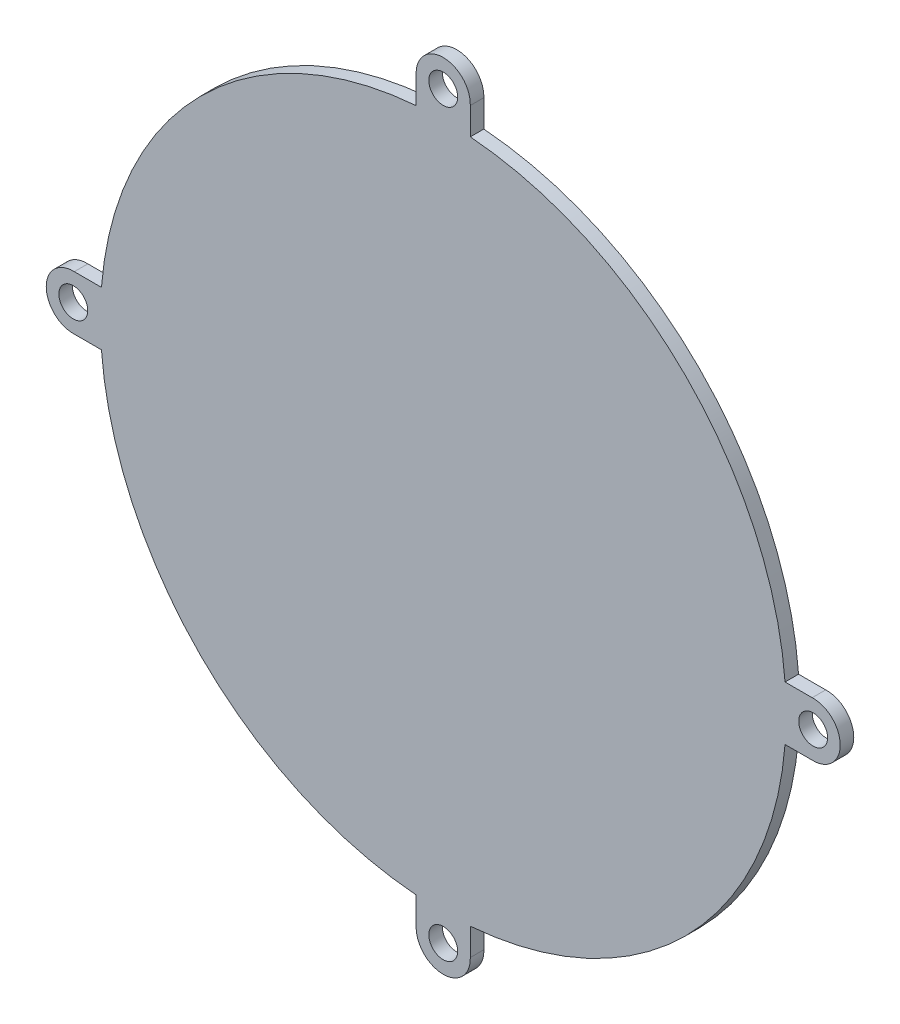
ISO-10303-21;
HEADER;
FILE_DESCRIPTION(('STEP AP214'),'2;1');
FILE_NAME('part.step','',(''),(''),'','','');
FILE_SCHEMA(('AUTOMOTIVE_DESIGN { 1 0 10303 214 1 1 1 1 }'));
ENDSEC;
DATA;
#1=APPLICATION_CONTEXT('core data for automotive mechanical design processes');
#2=APPLICATION_PROTOCOL_DEFINITION('international standard','automotive_design',2000,#1);
#3=PRODUCT_CONTEXT('',#1,'mechanical');
#4=PRODUCT('Part','Part','',(#3));
#5=PRODUCT_RELATED_PRODUCT_CATEGORY('part','',(#4));
#6=PRODUCT_DEFINITION_FORMATION('','',#4);
#7=PRODUCT_DEFINITION_CONTEXT('part definition',#1,'design');
#8=PRODUCT_DEFINITION('design','',#6,#7);
#9=PRODUCT_DEFINITION_SHAPE('','',#8);
#10=(LENGTH_UNIT() NAMED_UNIT(*) SI_UNIT(.MILLI.,.METRE.));
#11=(NAMED_UNIT(*) PLANE_ANGLE_UNIT() SI_UNIT($,.RADIAN.));
#12=(NAMED_UNIT(*) SI_UNIT($,.STERADIAN.) SOLID_ANGLE_UNIT());
#13=UNCERTAINTY_MEASURE_WITH_UNIT(LENGTH_MEASURE(1.E-05),#10,'distance_accuracy_value','');
#14=(GEOMETRIC_REPRESENTATION_CONTEXT(3) GLOBAL_UNCERTAINTY_ASSIGNED_CONTEXT((#13)) GLOBAL_UNIT_ASSIGNED_CONTEXT((#10,
#11,#12)) REPRESENTATION_CONTEXT('',''));
#15=CARTESIAN_POINT('',(0.,0.,0.));
#16=DIRECTION('',(0.,0.,1.));
#17=DIRECTION('',(1.,0.,0.));
#18=AXIS2_PLACEMENT_3D('',#15,#16,#17);
#19=CARTESIAN_POINT('',(41.,-1.43150734892568E-13,1.5));
#20=DIRECTION('',(0.,0.,1.));
#21=DIRECTION('',(1.,0.,0.));
#22=AXIS2_PLACEMENT_3D('',#19,#20,#21);
#23=PLANE('',#22);
#24=CARTESIAN_POINT('',(-2.86301469785137E-13,-41.,1.5));
#25=DIRECTION('',(0.,0.,1.));
#26=DIRECTION('',(1.,0.,0.));
#27=AXIS2_PLACEMENT_3D('',#24,#25,#26);
#28=CIRCLE('',#27,1.6);
#29=CARTESIAN_POINT('',(1.59999999999971,-41.,1.5));
#30=VERTEX_POINT('',#29);
#31=EDGE_CURVE('E343',#30,#30,#28,.T.);
#32=ORIENTED_EDGE('',*,*,#31,.F.);
#33=EDGE_LOOP('',(#32));
#34=FACE_BOUND('',#33,.T.);
#35=CARTESIAN_POINT('',(0.,41.,1.5));
#36=DIRECTION('',(0.,0.,1.));
#37=DIRECTION('',(1.,0.,0.));
#38=AXIS2_PLACEMENT_3D('',#35,#36,#37);
#39=CIRCLE('',#38,1.6);
#40=CARTESIAN_POINT('',(1.6,41.,1.5));
#41=VERTEX_POINT('',#40);
#42=EDGE_CURVE('E182',#41,#41,#39,.T.);
#43=ORIENTED_EDGE('',*,*,#42,.F.);
#44=EDGE_LOOP('',(#43));
#45=FACE_BOUND('',#44,.T.);
#46=CARTESIAN_POINT('',(41.,-1.43150734892568E-13,1.5));
#47=DIRECTION('',(0.,0.,1.));
#48=DIRECTION('',(1.,0.,0.));
#49=AXIS2_PLACEMENT_3D('',#46,#47,#48);
#50=CIRCLE('',#49,3.00000000000007);
#51=CARTESIAN_POINT('',(40.890243902439,-2.99799159422588,1.5));
#52=VERTEX_POINT('',#51);
#53=CARTESIAN_POINT('',(40.8902439024388,2.99799159422573,1.5));
#54=VERTEX_POINT('',#53);
#55=EDGE_CURVE('E209',#52,#54,#50,.T.);
#56=ORIENTED_EDGE('',*,*,#55,.T.);
#57=DIRECTION('',(-1.,3.27492227516778E-13,0.));
#58=VECTOR('',#57,1.);
#59=CARTESIAN_POINT('',(37.8815528509715,2.99799159422672,1.5));
#60=LINE('',#59,#58);
#61=CARTESIAN_POINT('',(37.8815528509715,2.99799159422672,1.5));
#62=VERTEX_POINT('',#61);
#63=EDGE_CURVE('E117',#54,#62,#60,.T.);
#64=ORIENTED_EDGE('',*,*,#63,.T.);
#65=CARTESIAN_POINT('',(0.,0.,1.5));
#66=DIRECTION('',(0.,0.,1.));
#67=DIRECTION('',(1.,0.,0.));
#68=AXIS2_PLACEMENT_3D('',#65,#66,#67);
#69=CIRCLE('',#68,38.);
#70=CARTESIAN_POINT('',(2.99799159422572,37.8815528509716,1.5));
#71=VERTEX_POINT('',#70);
#72=EDGE_CURVE('E248',#62,#71,#69,.T.);
#73=ORIENTED_EDGE('',*,*,#72,.T.);
#74=DIRECTION('',(0.,1.,0.));
#75=VECTOR('',#74,1.);
#76=CARTESIAN_POINT('',(2.99799159422574,40.890243902439,1.5));
#77=LINE('',#76,#75);
#78=CARTESIAN_POINT('',(2.99799159422574,40.890243902439,1.5));
#79=VERTEX_POINT('',#78);
#80=EDGE_CURVE('E267',#71,#79,#77,.T.);
#81=ORIENTED_EDGE('',*,*,#80,.T.);
#82=CARTESIAN_POINT('',(0.,41.,1.5));
#83=DIRECTION('',(0.,0.,1.));
#84=DIRECTION('',(1.,0.,0.));
#85=AXIS2_PLACEMENT_3D('',#82,#83,#84);
#86=CIRCLE('',#85,3.);
#87=CARTESIAN_POINT('',(-2.99799159422574,40.890243902439,1.5));
#88=VERTEX_POINT('',#87);
#89=EDGE_CURVE('E264',#79,#88,#86,.T.);
#90=ORIENTED_EDGE('',*,*,#89,.T.);
#91=DIRECTION('',(0.,-1.,0.));
#92=VECTOR('',#91,1.);
#93=CARTESIAN_POINT('',(-2.99799159422575,37.8815528509716,1.5));
#94=LINE('',#93,#92);
#95=CARTESIAN_POINT('',(-2.99799159422575,37.8815528509716,1.5));
#96=VERTEX_POINT('',#95);
#97=EDGE_CURVE('E266',#88,#96,#94,.T.);
#98=ORIENTED_EDGE('',*,*,#97,.T.);
#99=CARTESIAN_POINT('',(0.,0.,1.5));
#100=DIRECTION('',(0.,0.,1.));
#101=DIRECTION('',(1.,0.,0.));
#102=AXIS2_PLACEMENT_3D('',#99,#100,#101);
#103=CIRCLE('',#102,38.);
#104=CARTESIAN_POINT('',(-37.8815528509715,2.99799159422618,1.5));
#105=VERTEX_POINT('',#104);
#106=EDGE_CURVE('E269',#96,#105,#103,.T.);
#107=ORIENTED_EDGE('',*,*,#106,.T.);
#108=DIRECTION('',(-1.,0.,0.));
#109=VECTOR('',#108,1.);
#110=CARTESIAN_POINT('',(-40.890243902439,2.99799159422617,1.5));
#111=LINE('',#110,#109);
#112=CARTESIAN_POINT('',(-40.890243902439,2.99799159422617,1.5));
#113=VERTEX_POINT('',#112);
#114=EDGE_CURVE('E275',#105,#113,#111,.T.);
#115=ORIENTED_EDGE('',*,*,#114,.T.);
#116=CARTESIAN_POINT('',(-41.,4.29452204677705E-13,1.5));
#117=DIRECTION('',(0.,0.,1.));
#118=DIRECTION('',(1.,0.,0.));
#119=AXIS2_PLACEMENT_3D('',#116,#117,#118);
#120=CIRCLE('',#119,3.00000000000051);
#121=CARTESIAN_POINT('',(-40.8902439024388,-2.99799159422581,1.5));
#122=VERTEX_POINT('',#121);
#123=EDGE_CURVE('E277',#113,#122,#120,.T.);
#124=ORIENTED_EDGE('',*,*,#123,.T.);
#125=DIRECTION('',(1.,0.,0.));
#126=VECTOR('',#125,1.);
#127=CARTESIAN_POINT('',(-37.8815528509715,-2.99799159422631,1.5));
#128=LINE('',#127,#126);
#129=CARTESIAN_POINT('',(-37.8815528509715,-2.99799159422631,1.5));
#130=VERTEX_POINT('',#129);
#131=EDGE_CURVE('E279',#122,#130,#128,.T.);
#132=ORIENTED_EDGE('',*,*,#131,.T.);
#133=CARTESIAN_POINT('',(0.,0.,1.5));
#134=DIRECTION('',(0.,0.,1.));
#135=DIRECTION('',(1.,0.,0.));
#136=AXIS2_PLACEMENT_3D('',#133,#134,#135);
#137=CIRCLE('',#136,38.);
#138=CARTESIAN_POINT('',(-2.99799159422603,-37.8815528509715,1.5));
#139=VERTEX_POINT('',#138);
#140=EDGE_CURVE('E281',#130,#139,#137,.T.);
#141=ORIENTED_EDGE('',*,*,#140,.T.);
#142=DIRECTION('',(0.,-1.,0.));
#143=VECTOR('',#142,1.);
#144=CARTESIAN_POINT('',(-2.99799159422602,-40.890243902439,1.5));
#145=LINE('',#144,#143);
#146=CARTESIAN_POINT('',(-2.99799159422602,-40.890243902439,1.5));
#147=VERTEX_POINT('',#146);
#148=EDGE_CURVE('E283',#139,#147,#145,.T.);
#149=ORIENTED_EDGE('',*,*,#148,.T.);
#150=CARTESIAN_POINT('',(-2.86301469785137E-13,-41.,1.5));
#151=DIRECTION('',(0.,0.,1.));
#152=DIRECTION('',(1.,0.,0.));
#153=AXIS2_PLACEMENT_3D('',#150,#151,#152);
#154=CIRCLE('',#153,3.);
#155=CARTESIAN_POINT('',(2.99799159422545,-40.890243902439,1.5));
#156=VERTEX_POINT('',#155);
#157=EDGE_CURVE('E160',#147,#156,#154,.T.);
#158=ORIENTED_EDGE('',*,*,#157,.T.);
#159=DIRECTION('',(0.,1.,0.));
#160=VECTOR('',#159,1.);
#161=CARTESIAN_POINT('',(2.99799159422546,-37.8815528509716,1.5));
#162=LINE('',#161,#160);
#163=CARTESIAN_POINT('',(2.99799159422546,-37.8815528509716,1.5));
#164=VERTEX_POINT('',#163);
#165=EDGE_CURVE('E154',#156,#164,#162,.T.);
#166=ORIENTED_EDGE('',*,*,#165,.T.);
#167=CARTESIAN_POINT('',(0.,0.,1.5));
#168=DIRECTION('',(0.,0.,1.));
#169=DIRECTION('',(1.,0.,0.));
#170=AXIS2_PLACEMENT_3D('',#167,#168,#169);
#171=CIRCLE('',#170,38.);
#172=CARTESIAN_POINT('',(37.8815528509716,-2.9979915942259,1.5));
#173=VERTEX_POINT('',#172);
#174=EDGE_CURVE('E158',#164,#173,#171,.T.);
#175=ORIENTED_EDGE('',*,*,#174,.T.);
#176=DIRECTION('',(1.,0.,0.));
#177=VECTOR('',#176,1.);
#178=CARTESIAN_POINT('',(40.890243902439,-2.99799159422588,1.5));
#179=LINE('',#178,#177);
#180=EDGE_CURVE('E50',#173,#52,#179,.T.);
#181=ORIENTED_EDGE('',*,*,#180,.T.);
#182=EDGE_LOOP('',(#56,#64,#73,#81,#90,#98,#107,#115,#124,#132,#141,#149,#158,#166,#175,#181));
#183=FACE_BOUND('',#182,.T.);
#184=CARTESIAN_POINT('',(41.,-1.43150734892568E-13,1.5));
#185=DIRECTION('',(0.,0.,1.));
#186=DIRECTION('',(1.,0.,0.));
#187=AXIS2_PLACEMENT_3D('',#184,#185,#186);
#188=CIRCLE('',#187,1.6);
#189=CARTESIAN_POINT('',(42.6,-1.43150734892568E-13,1.5));
#190=VERTEX_POINT('',#189);
#191=EDGE_CURVE('E349',#190,#190,#188,.T.);
#192=ORIENTED_EDGE('',*,*,#191,.F.);
#193=EDGE_LOOP('',(#192));
#194=FACE_BOUND('',#193,.T.);
#195=CARTESIAN_POINT('',(-41.,4.29452204677705E-13,1.5));
#196=DIRECTION('',(0.,0.,1.));
#197=DIRECTION('',(1.,0.,0.));
#198=AXIS2_PLACEMENT_3D('',#195,#196,#197);
#199=CIRCLE('',#198,1.6);
#200=CARTESIAN_POINT('',(-39.4,4.29452204677705E-13,1.5));
#201=VERTEX_POINT('',#200);
#202=EDGE_CURVE('E334',#201,#201,#199,.T.);
#203=ORIENTED_EDGE('',*,*,#202,.F.);
#204=EDGE_LOOP('',(#203));
#205=FACE_BOUND('',#204,.T.);
#206=ADVANCED_FACE('F33',(#34,#45,#183,#194,#205),#23,.T.);
#207=CARTESIAN_POINT('',(41.,-1.43150734892568E-13,0.));
#208=DIRECTION('',(0.,0.,1.));
#209=DIRECTION('',(1.,0.,0.));
#210=AXIS2_PLACEMENT_3D('',#207,#208,#209);
#211=PLANE('',#210);
#212=CARTESIAN_POINT('',(41.,-1.43150734892568E-13,0.));
#213=DIRECTION('',(0.,0.,1.));
#214=DIRECTION('',(1.,0.,0.));
#215=AXIS2_PLACEMENT_3D('',#212,#213,#214);
#216=CIRCLE('',#215,3.00000000000007);
#217=CARTESIAN_POINT('',(40.890243902439,-2.99799159422588,0.));
#218=VERTEX_POINT('',#217);
#219=CARTESIAN_POINT('',(40.8902439024388,2.99799159422573,0.));
#220=VERTEX_POINT('',#219);
#221=EDGE_CURVE('E178',#218,#220,#216,.T.);
#222=ORIENTED_EDGE('',*,*,#221,.F.);
#223=DIRECTION('',(1.,0.,0.));
#224=VECTOR('',#223,1.);
#225=CARTESIAN_POINT('',(40.890243902439,-2.99799159422588,0.));
#226=LINE('',#225,#224);
#227=CARTESIAN_POINT('',(37.8815528509716,-2.9979915942259,0.));
#228=VERTEX_POINT('',#227);
#229=EDGE_CURVE('E109',#228,#218,#226,.T.);
#230=ORIENTED_EDGE('',*,*,#229,.F.);
#231=CARTESIAN_POINT('',(0.,0.,0.));
#232=DIRECTION('',(0.,0.,1.));
#233=DIRECTION('',(1.,0.,0.));
#234=AXIS2_PLACEMENT_3D('',#231,#232,#233);
#235=CIRCLE('',#234,38.);
#236=CARTESIAN_POINT('',(2.99799159422546,-37.8815528509716,0.));
#237=VERTEX_POINT('',#236);
#238=EDGE_CURVE('E103',#237,#228,#235,.T.);
#239=ORIENTED_EDGE('',*,*,#238,.F.);
#240=DIRECTION('',(0.,1.,0.));
#241=VECTOR('',#240,1.);
#242=CARTESIAN_POINT('',(2.99799159422546,-37.8815528509716,0.));
#243=LINE('',#242,#241);
#244=CARTESIAN_POINT('',(2.99799159422545,-40.890243902439,0.));
#245=VERTEX_POINT('',#244);
#246=EDGE_CURVE('E168',#245,#237,#243,.T.);
#247=ORIENTED_EDGE('',*,*,#246,.F.);
#248=CARTESIAN_POINT('',(-2.86301469785137E-13,-41.,0.));
#249=DIRECTION('',(0.,0.,1.));
#250=DIRECTION('',(1.,0.,0.));
#251=AXIS2_PLACEMENT_3D('',#248,#249,#250);
#252=CIRCLE('',#251,3.);
#253=CARTESIAN_POINT('',(-2.99799159422602,-40.890243902439,0.));
#254=VERTEX_POINT('',#253);
#255=EDGE_CURVE('E204',#254,#245,#252,.T.);
#256=ORIENTED_EDGE('',*,*,#255,.F.);
#257=DIRECTION('',(0.,-1.,0.));
#258=VECTOR('',#257,1.);
#259=CARTESIAN_POINT('',(-2.99799159422602,-40.890243902439,0.));
#260=LINE('',#259,#258);
#261=CARTESIAN_POINT('',(-2.99799159422603,-37.8815528509715,0.));
#262=VERTEX_POINT('',#261);
#263=EDGE_CURVE('E202',#262,#254,#260,.T.);
#264=ORIENTED_EDGE('',*,*,#263,.F.);
#265=CARTESIAN_POINT('',(0.,0.,0.));
#266=DIRECTION('',(0.,0.,1.));
#267=DIRECTION('',(1.,0.,0.));
#268=AXIS2_PLACEMENT_3D('',#265,#266,#267);
#269=CIRCLE('',#268,38.);
#270=CARTESIAN_POINT('',(-37.8815528509715,-2.99799159422631,0.));
#271=VERTEX_POINT('',#270);
#272=EDGE_CURVE('E200',#271,#262,#269,.T.);
#273=ORIENTED_EDGE('',*,*,#272,.F.);
#274=DIRECTION('',(1.,0.,0.));
#275=VECTOR('',#274,1.);
#276=CARTESIAN_POINT('',(-37.8815528509715,-2.99799159422631,0.));
#277=LINE('',#276,#275);
#278=CARTESIAN_POINT('',(-40.8902439024388,-2.99799159422581,0.));
#279=VERTEX_POINT('',#278);
#280=EDGE_CURVE('E198',#279,#271,#277,.T.);
#281=ORIENTED_EDGE('',*,*,#280,.F.);
#282=CARTESIAN_POINT('',(-41.,4.29452204677705E-13,0.));
#283=DIRECTION('',(0.,0.,1.));
#284=DIRECTION('',(1.,0.,0.));
#285=AXIS2_PLACEMENT_3D('',#282,#283,#284);
#286=CIRCLE('',#285,3.00000000000051);
#287=CARTESIAN_POINT('',(-40.890243902439,2.99799159422617,0.));
#288=VERTEX_POINT('',#287);
#289=EDGE_CURVE('E196',#288,#279,#286,.T.);
#290=ORIENTED_EDGE('',*,*,#289,.F.);
#291=DIRECTION('',(-1.,0.,0.));
#292=VECTOR('',#291,1.);
#293=CARTESIAN_POINT('',(-40.890243902439,2.99799159422617,0.));
#294=LINE('',#293,#292);
#295=CARTESIAN_POINT('',(-37.8815528509715,2.99799159422618,0.));
#296=VERTEX_POINT('',#295);
#297=EDGE_CURVE('E194',#296,#288,#294,.T.);
#298=ORIENTED_EDGE('',*,*,#297,.F.);
#299=CARTESIAN_POINT('',(0.,0.,0.));
#300=DIRECTION('',(0.,0.,1.));
#301=DIRECTION('',(1.,0.,0.));
#302=AXIS2_PLACEMENT_3D('',#299,#300,#301);
#303=CIRCLE('',#302,38.);
#304=CARTESIAN_POINT('',(-2.99799159422575,37.8815528509716,0.));
#305=VERTEX_POINT('',#304);
#306=EDGE_CURVE('E192',#305,#296,#303,.T.);
#307=ORIENTED_EDGE('',*,*,#306,.F.);
#308=DIRECTION('',(0.,-1.,0.));
#309=VECTOR('',#308,1.);
#310=CARTESIAN_POINT('',(-2.99799159422575,37.8815528509716,0.));
#311=LINE('',#310,#309);
#312=CARTESIAN_POINT('',(-2.99799159422574,40.890243902439,0.));
#313=VERTEX_POINT('',#312);
#314=EDGE_CURVE('E190',#313,#305,#311,.T.);
#315=ORIENTED_EDGE('',*,*,#314,.F.);
#316=CARTESIAN_POINT('',(0.,41.,0.));
#317=DIRECTION('',(0.,0.,1.));
#318=DIRECTION('',(1.,0.,0.));
#319=AXIS2_PLACEMENT_3D('',#316,#317,#318);
#320=CIRCLE('',#319,3.);
#321=CARTESIAN_POINT('',(2.99799159422574,40.890243902439,0.));
#322=VERTEX_POINT('',#321);
#323=EDGE_CURVE('E188',#322,#313,#320,.T.);
#324=ORIENTED_EDGE('',*,*,#323,.F.);
#325=DIRECTION('',(0.,1.,0.));
#326=VECTOR('',#325,1.);
#327=CARTESIAN_POINT('',(2.99799159422574,40.890243902439,0.));
#328=LINE('',#327,#326);
#329=CARTESIAN_POINT('',(2.99799159422572,37.8815528509716,0.));
#330=VERTEX_POINT('',#329);
#331=EDGE_CURVE('E186',#330,#322,#328,.T.);
#332=ORIENTED_EDGE('',*,*,#331,.F.);
#333=CARTESIAN_POINT('',(0.,0.,0.));
#334=DIRECTION('',(0.,0.,1.));
#335=DIRECTION('',(1.,0.,0.));
#336=AXIS2_PLACEMENT_3D('',#333,#334,#335);
#337=CIRCLE('',#336,38.);
#338=CARTESIAN_POINT('',(37.8815528509715,2.99799159422672,0.));
#339=VERTEX_POINT('',#338);
#340=EDGE_CURVE('E184',#339,#330,#337,.T.);
#341=ORIENTED_EDGE('',*,*,#340,.F.);
#342=DIRECTION('',(-1.,3.27492227516778E-13,0.));
#343=VECTOR('',#342,1.);
#344=CARTESIAN_POINT('',(37.8815528509715,2.99799159422672,0.));
#345=LINE('',#344,#343);
#346=EDGE_CURVE('E181',#220,#339,#345,.T.);
#347=ORIENTED_EDGE('',*,*,#346,.F.);
#348=EDGE_LOOP('',(#222,#230,#239,#247,#256,#264,#273,#281,#290,#298,#307,#315,#324,#332,#341,#347));
#349=FACE_BOUND('',#348,.T.);
#350=CARTESIAN_POINT('',(0.,41.,0.));
#351=DIRECTION('',(0.,0.,1.));
#352=DIRECTION('',(1.,0.,0.));
#353=AXIS2_PLACEMENT_3D('',#350,#351,#352);
#354=CIRCLE('',#353,1.6);
#355=CARTESIAN_POINT('',(1.6,41.,0.));
#356=VERTEX_POINT('',#355);
#357=EDGE_CURVE('E352',#356,#356,#354,.T.);
#358=ORIENTED_EDGE('',*,*,#357,.T.);
#359=EDGE_LOOP('',(#358));
#360=FACE_BOUND('',#359,.T.);
#361=CARTESIAN_POINT('',(41.,-1.43150734892568E-13,0.));
#362=DIRECTION('',(0.,0.,1.));
#363=DIRECTION('',(1.,0.,0.));
#364=AXIS2_PLACEMENT_3D('',#361,#362,#363);
#365=CIRCLE('',#364,1.6);
#366=CARTESIAN_POINT('',(42.6,-1.43150734892568E-13,0.));
#367=VERTEX_POINT('',#366);
#368=EDGE_CURVE('E346',#367,#367,#365,.T.);
#369=ORIENTED_EDGE('',*,*,#368,.T.);
#370=EDGE_LOOP('',(#369));
#371=FACE_BOUND('',#370,.T.);
#372=CARTESIAN_POINT('',(-2.86301469785137E-13,-41.,0.));
#373=DIRECTION('',(0.,0.,1.));
#374=DIRECTION('',(1.,0.,0.));
#375=AXIS2_PLACEMENT_3D('',#372,#373,#374);
#376=CIRCLE('',#375,1.6);
#377=CARTESIAN_POINT('',(1.59999999999971,-41.,0.));
#378=VERTEX_POINT('',#377);
#379=EDGE_CURVE('E340',#378,#378,#376,.T.);
#380=ORIENTED_EDGE('',*,*,#379,.T.);
#381=EDGE_LOOP('',(#380));
#382=FACE_BOUND('',#381,.T.);
#383=CARTESIAN_POINT('',(-41.,4.29452204677705E-13,0.));
#384=DIRECTION('',(0.,0.,1.));
#385=DIRECTION('',(1.,0.,0.));
#386=AXIS2_PLACEMENT_3D('',#383,#384,#385);
#387=CIRCLE('',#386,1.6);
#388=CARTESIAN_POINT('',(-39.4,4.29452204677705E-13,0.));
#389=VERTEX_POINT('',#388);
#390=EDGE_CURVE('E337',#389,#389,#387,.T.);
#391=ORIENTED_EDGE('',*,*,#390,.T.);
#392=EDGE_LOOP('',(#391));
#393=FACE_BOUND('',#392,.T.);
#394=ADVANCED_FACE('F252',(#349,#360,#371,#382,#393),#211,.F.);
#395=CARTESIAN_POINT('',(41.,-1.43150734892568E-13,1.5));
#396=DIRECTION('',(0.,0.,-1.));
#397=DIRECTION('',(-1.,0.,0.));
#398=AXIS2_PLACEMENT_3D('',#395,#396,#397);
#399=CYLINDRICAL_SURFACE('',#398,3.00000000000007);
#400=ORIENTED_EDGE('',*,*,#221,.T.);
#401=DIRECTION('',(0.,0.,-1.));
#402=VECTOR('',#401,1.);
#403=CARTESIAN_POINT('',(40.8902439024388,2.99799159422573,1.5));
#404=LINE('',#403,#402);
#405=EDGE_CURVE('E11',#54,#220,#404,.T.);
#406=ORIENTED_EDGE('',*,*,#405,.F.);
#407=ORIENTED_EDGE('',*,*,#55,.F.);
#408=DIRECTION('',(0.,0.,-1.));
#409=VECTOR('',#408,1.);
#410=CARTESIAN_POINT('',(40.890243902439,-2.99799159422588,1.5));
#411=LINE('',#410,#409);
#412=EDGE_CURVE('E174',#52,#218,#411,.T.);
#413=ORIENTED_EDGE('',*,*,#412,.T.);
#414=EDGE_LOOP('',(#400,#406,#407,#413));
#415=FACE_BOUND('',#414,.T.);
#416=ADVANCED_FACE('F35',(#415),#399,.T.);
#417=CARTESIAN_POINT('',(37.8815528509715,2.99799159422672,1.5));
#418=DIRECTION('',(-3.27492227516778E-13,-1.,0.));
#419=DIRECTION('',(1.,-3.27492227516778E-13,0.));
#420=AXIS2_PLACEMENT_3D('',#417,#418,#419);
#421=PLANE('',#420);
#422=ORIENTED_EDGE('',*,*,#346,.T.);
#423=DIRECTION('',(0.,0.,-1.));
#424=VECTOR('',#423,1.);
#425=CARTESIAN_POINT('',(37.8815528509715,2.99799159422672,1.5));
#426=LINE('',#425,#424);
#427=EDGE_CURVE('E42',#62,#339,#426,.T.);
#428=ORIENTED_EDGE('',*,*,#427,.F.);
#429=ORIENTED_EDGE('',*,*,#63,.F.);
#430=ORIENTED_EDGE('',*,*,#405,.T.);
#431=EDGE_LOOP('',(#422,#428,#429,#430));
#432=FACE_BOUND('',#431,.T.);
#433=ADVANCED_FACE('F502',(#432),#421,.F.);
#434=CARTESIAN_POINT('',(0.,0.,1.5));
#435=DIRECTION('',(0.,0.,-1.));
#436=DIRECTION('',(-1.,0.,0.));
#437=AXIS2_PLACEMENT_3D('',#434,#435,#436);
#438=CYLINDRICAL_SURFACE('',#437,38.);
#439=ORIENTED_EDGE('',*,*,#340,.T.);
#440=DIRECTION('',(0.,0.,-1.));
#441=VECTOR('',#440,1.);
#442=CARTESIAN_POINT('',(2.99799159422572,37.8815528509716,1.5));
#443=LINE('',#442,#441);
#444=EDGE_CURVE('E240',#71,#330,#443,.T.);
#445=ORIENTED_EDGE('',*,*,#444,.F.);
#446=ORIENTED_EDGE('',*,*,#72,.F.);
#447=ORIENTED_EDGE('',*,*,#427,.T.);
#448=EDGE_LOOP('',(#439,#445,#446,#447));
#449=FACE_BOUND('',#448,.T.);
#450=ADVANCED_FACE('F246',(#449),#438,.T.);
#451=CARTESIAN_POINT('',(2.99799159422574,40.890243902439,1.5));
#452=DIRECTION('',(-1.,0.,0.));
#453=DIRECTION('',(0.,-1.,0.));
#454=AXIS2_PLACEMENT_3D('',#451,#452,#453);
#455=PLANE('',#454);
#456=ORIENTED_EDGE('',*,*,#331,.T.);
#457=DIRECTION('',(0.,0.,-1.));
#458=VECTOR('',#457,1.);
#459=CARTESIAN_POINT('',(2.99799159422574,40.890243902439,1.5));
#460=LINE('',#459,#458);
#461=EDGE_CURVE('E237',#79,#322,#460,.T.);
#462=ORIENTED_EDGE('',*,*,#461,.F.);
#463=ORIENTED_EDGE('',*,*,#80,.F.);
#464=ORIENTED_EDGE('',*,*,#444,.T.);
#465=EDGE_LOOP('',(#456,#462,#463,#464));
#466=FACE_BOUND('',#465,.T.);
#467=ADVANCED_FACE('F258',(#466),#455,.F.);
#468=CARTESIAN_POINT('',(0.,41.,1.5));
#469=DIRECTION('',(0.,0.,-1.));
#470=DIRECTION('',(-1.,0.,0.));
#471=AXIS2_PLACEMENT_3D('',#468,#469,#470);
#472=CYLINDRICAL_SURFACE('',#471,3.);
#473=ORIENTED_EDGE('',*,*,#323,.T.);
#474=DIRECTION('',(0.,0.,-1.));
#475=VECTOR('',#474,1.);
#476=CARTESIAN_POINT('',(-2.99799159422574,40.890243902439,1.5));
#477=LINE('',#476,#475);
#478=EDGE_CURVE('E234',#88,#313,#477,.T.);
#479=ORIENTED_EDGE('',*,*,#478,.F.);
#480=ORIENTED_EDGE('',*,*,#89,.F.);
#481=ORIENTED_EDGE('',*,*,#461,.T.);
#482=EDGE_LOOP('',(#473,#479,#480,#481));
#483=FACE_BOUND('',#482,.T.);
#484=ADVANCED_FACE('F262',(#483),#472,.T.);
#485=CARTESIAN_POINT('',(-2.99799159422575,37.8815528509716,1.5));
#486=DIRECTION('',(1.,0.,0.));
#487=DIRECTION('',(0.,1.,0.));
#488=AXIS2_PLACEMENT_3D('',#485,#486,#487);
#489=PLANE('',#488);
#490=ORIENTED_EDGE('',*,*,#314,.T.);
#491=DIRECTION('',(0.,0.,-1.));
#492=VECTOR('',#491,1.);
#493=CARTESIAN_POINT('',(-2.99799159422575,37.8815528509716,1.5));
#494=LINE('',#493,#492);
#495=EDGE_CURVE('E231',#96,#305,#494,.T.);
#496=ORIENTED_EDGE('',*,*,#495,.F.);
#497=ORIENTED_EDGE('',*,*,#97,.F.);
#498=ORIENTED_EDGE('',*,*,#478,.T.);
#499=EDGE_LOOP('',(#490,#496,#497,#498));
#500=FACE_BOUND('',#499,.T.);
#501=ADVANCED_FACE('F467',(#500),#489,.F.);
#502=CARTESIAN_POINT('',(0.,0.,1.5));
#503=DIRECTION('',(0.,0.,-1.));
#504=DIRECTION('',(-1.,0.,0.));
#505=AXIS2_PLACEMENT_3D('',#502,#503,#504);
#506=CYLINDRICAL_SURFACE('',#505,38.);
#507=ORIENTED_EDGE('',*,*,#306,.T.);
#508=DIRECTION('',(0.,0.,-1.));
#509=VECTOR('',#508,1.);
#510=CARTESIAN_POINT('',(-37.8815528509715,2.99799159422618,1.5));
#511=LINE('',#510,#509);
#512=EDGE_CURVE('E228',#105,#296,#511,.T.);
#513=ORIENTED_EDGE('',*,*,#512,.F.);
#514=ORIENTED_EDGE('',*,*,#106,.F.);
#515=ORIENTED_EDGE('',*,*,#495,.T.);
#516=EDGE_LOOP('',(#507,#513,#514,#515));
#517=FACE_BOUND('',#516,.T.);
#518=ADVANCED_FACE('F457',(#517),#506,.T.);
#519=CARTESIAN_POINT('',(-40.890243902439,2.99799159422617,1.5));
#520=DIRECTION('',(0.,-1.,0.));
#521=DIRECTION('',(1.,0.,0.));
#522=AXIS2_PLACEMENT_3D('',#519,#520,#521);
#523=PLANE('',#522);
#524=ORIENTED_EDGE('',*,*,#297,.T.);
#525=DIRECTION('',(0.,0.,-1.));
#526=VECTOR('',#525,1.);
#527=CARTESIAN_POINT('',(-40.890243902439,2.99799159422617,1.5));
#528=LINE('',#527,#526);
#529=EDGE_CURVE('E225',#113,#288,#528,.T.);
#530=ORIENTED_EDGE('',*,*,#529,.F.);
#531=ORIENTED_EDGE('',*,*,#114,.F.);
#532=ORIENTED_EDGE('',*,*,#512,.T.);
#533=EDGE_LOOP('',(#524,#530,#531,#532));
#534=FACE_BOUND('',#533,.T.);
#535=ADVANCED_FACE('F447',(#534),#523,.F.);
#536=CARTESIAN_POINT('',(-41.,4.29452204677705E-13,1.5));
#537=DIRECTION('',(0.,0.,-1.));
#538=DIRECTION('',(-1.,0.,0.));
#539=AXIS2_PLACEMENT_3D('',#536,#537,#538);
#540=CYLINDRICAL_SURFACE('',#539,3.00000000000051);
#541=ORIENTED_EDGE('',*,*,#289,.T.);
#542=DIRECTION('',(0.,0.,-1.));
#543=VECTOR('',#542,1.);
#544=CARTESIAN_POINT('',(-40.8902439024388,-2.99799159422581,1.5));
#545=LINE('',#544,#543);
#546=EDGE_CURVE('E222',#122,#279,#545,.T.);
#547=ORIENTED_EDGE('',*,*,#546,.F.);
#548=ORIENTED_EDGE('',*,*,#123,.F.);
#549=ORIENTED_EDGE('',*,*,#529,.T.);
#550=EDGE_LOOP('',(#541,#547,#548,#549));
#551=FACE_BOUND('',#550,.T.);
#552=ADVANCED_FACE('F437',(#551),#540,.T.);
#553=CARTESIAN_POINT('',(-37.8815528509715,-2.99799159422631,1.5));
#554=DIRECTION('',(0.,1.,0.));
#555=DIRECTION('',(-1.,0.,0.));
#556=AXIS2_PLACEMENT_3D('',#553,#554,#555);
#557=PLANE('',#556);
#558=ORIENTED_EDGE('',*,*,#280,.T.);
#559=DIRECTION('',(0.,0.,-1.));
#560=VECTOR('',#559,1.);
#561=CARTESIAN_POINT('',(-37.8815528509715,-2.99799159422631,1.5));
#562=LINE('',#561,#560);
#563=EDGE_CURVE('E219',#130,#271,#562,.T.);
#564=ORIENTED_EDGE('',*,*,#563,.F.);
#565=ORIENTED_EDGE('',*,*,#131,.F.);
#566=ORIENTED_EDGE('',*,*,#546,.T.);
#567=EDGE_LOOP('',(#558,#564,#565,#566));
#568=FACE_BOUND('',#567,.T.);
#569=ADVANCED_FACE('F427',(#568),#557,.F.);
#570=CARTESIAN_POINT('',(0.,0.,1.5));
#571=DIRECTION('',(0.,0.,-1.));
#572=DIRECTION('',(-1.,0.,0.));
#573=AXIS2_PLACEMENT_3D('',#570,#571,#572);
#574=CYLINDRICAL_SURFACE('',#573,38.);
#575=ORIENTED_EDGE('',*,*,#272,.T.);
#576=DIRECTION('',(0.,0.,-1.));
#577=VECTOR('',#576,1.);
#578=CARTESIAN_POINT('',(-2.99799159422603,-37.8815528509715,1.5));
#579=LINE('',#578,#577);
#580=EDGE_CURVE('E216',#139,#262,#579,.T.);
#581=ORIENTED_EDGE('',*,*,#580,.F.);
#582=ORIENTED_EDGE('',*,*,#140,.F.);
#583=ORIENTED_EDGE('',*,*,#563,.T.);
#584=EDGE_LOOP('',(#575,#581,#582,#583));
#585=FACE_BOUND('',#584,.T.);
#586=ADVANCED_FACE('F418',(#585),#574,.T.);
#587=CARTESIAN_POINT('',(-2.99799159422602,-40.890243902439,1.5));
#588=DIRECTION('',(1.,0.,0.));
#589=DIRECTION('',(0.,1.,0.));
#590=AXIS2_PLACEMENT_3D('',#587,#588,#589);
#591=PLANE('',#590);
#592=ORIENTED_EDGE('',*,*,#263,.T.);
#593=DIRECTION('',(0.,0.,-1.));
#594=VECTOR('',#593,1.);
#595=CARTESIAN_POINT('',(-2.99799159422602,-40.890243902439,1.5));
#596=LINE('',#595,#594);
#597=EDGE_CURVE('E213',#147,#254,#596,.T.);
#598=ORIENTED_EDGE('',*,*,#597,.F.);
#599=ORIENTED_EDGE('',*,*,#148,.F.);
#600=ORIENTED_EDGE('',*,*,#580,.T.);
#601=EDGE_LOOP('',(#592,#598,#599,#600));
#602=FACE_BOUND('',#601,.T.);
#603=ADVANCED_FACE('F289',(#602),#591,.F.);
#604=CARTESIAN_POINT('',(-2.86301469785137E-13,-41.,1.5));
#605=DIRECTION('',(0.,0.,-1.));
#606=DIRECTION('',(-1.,0.,0.));
#607=AXIS2_PLACEMENT_3D('',#604,#605,#606);
#608=CYLINDRICAL_SURFACE('',#607,3.);
#609=ORIENTED_EDGE('',*,*,#255,.T.);
#610=DIRECTION('',(0.,0.,-1.));
#611=VECTOR('',#610,1.);
#612=CARTESIAN_POINT('',(2.99799159422545,-40.890243902439,1.5));
#613=LINE('',#612,#611);
#614=EDGE_CURVE('E169',#156,#245,#613,.T.);
#615=ORIENTED_EDGE('',*,*,#614,.F.);
#616=ORIENTED_EDGE('',*,*,#157,.F.);
#617=ORIENTED_EDGE('',*,*,#597,.T.);
#618=EDGE_LOOP('',(#609,#615,#616,#617));
#619=FACE_BOUND('',#618,.T.);
#620=ADVANCED_FACE('F293',(#619),#608,.T.);
#621=CARTESIAN_POINT('',(2.99799159422546,-37.8815528509716,1.5));
#622=DIRECTION('',(-1.,0.,0.));
#623=DIRECTION('',(0.,-1.,0.));
#624=AXIS2_PLACEMENT_3D('',#621,#622,#623);
#625=PLANE('',#624);
#626=ORIENTED_EDGE('',*,*,#246,.T.);
#627=DIRECTION('',(0.,0.,-1.));
#628=VECTOR('',#627,1.);
#629=CARTESIAN_POINT('',(2.99799159422546,-37.8815528509716,1.5));
#630=LINE('',#629,#628);
#631=EDGE_CURVE('E165',#164,#237,#630,.T.);
#632=ORIENTED_EDGE('',*,*,#631,.F.);
#633=ORIENTED_EDGE('',*,*,#165,.F.);
#634=ORIENTED_EDGE('',*,*,#614,.T.);
#635=EDGE_LOOP('',(#626,#632,#633,#634));
#636=FACE_BOUND('',#635,.T.);
#637=ADVANCED_FACE('F166',(#636),#625,.F.);
#638=CARTESIAN_POINT('',(0.,0.,1.5));
#639=DIRECTION('',(0.,0.,-1.));
#640=DIRECTION('',(-1.,0.,0.));
#641=AXIS2_PLACEMENT_3D('',#638,#639,#640);
#642=CYLINDRICAL_SURFACE('',#641,38.);
#643=ORIENTED_EDGE('',*,*,#238,.T.);
#644=DIRECTION('',(0.,0.,-1.));
#645=VECTOR('',#644,1.);
#646=CARTESIAN_POINT('',(37.8815528509716,-2.9979915942259,1.5));
#647=LINE('',#646,#645);
#648=EDGE_CURVE('E170',#173,#228,#647,.T.);
#649=ORIENTED_EDGE('',*,*,#648,.F.);
#650=ORIENTED_EDGE('',*,*,#174,.F.);
#651=ORIENTED_EDGE('',*,*,#631,.T.);
#652=EDGE_LOOP('',(#643,#649,#650,#651));
#653=FACE_BOUND('',#652,.T.);
#654=ADVANCED_FACE('F172',(#653),#642,.T.);
#655=CARTESIAN_POINT('',(40.890243902439,-2.99799159422588,1.5));
#656=DIRECTION('',(0.,1.,0.));
#657=DIRECTION('',(-1.,0.,0.));
#658=AXIS2_PLACEMENT_3D('',#655,#656,#657);
#659=PLANE('',#658);
#660=ORIENTED_EDGE('',*,*,#229,.T.);
#661=ORIENTED_EDGE('',*,*,#412,.F.);
#662=ORIENTED_EDGE('',*,*,#180,.F.);
#663=ORIENTED_EDGE('',*,*,#648,.T.);
#664=EDGE_LOOP('',(#660,#661,#662,#663));
#665=FACE_BOUND('',#664,.T.);
#666=ADVANCED_FACE('F297',(#665),#659,.F.);
#667=CARTESIAN_POINT('',(0.,41.,1.5));
#668=DIRECTION('',(0.,0.,-1.));
#669=DIRECTION('',(-1.,0.,0.));
#670=AXIS2_PLACEMENT_3D('',#667,#668,#669);
#671=CYLINDRICAL_SURFACE('',#670,1.6);
#672=ORIENTED_EDGE('',*,*,#42,.T.);
#673=EDGE_LOOP('',(#672));
#674=FACE_BOUND('',#673,.T.);
#675=ORIENTED_EDGE('',*,*,#357,.F.);
#676=EDGE_LOOP('',(#675));
#677=FACE_BOUND('',#676,.T.);
#678=ADVANCED_FACE('F299',(#674,#677),#671,.F.);
#679=CARTESIAN_POINT('',(41.,-1.43150734892568E-13,1.5));
#680=DIRECTION('',(0.,0.,-1.));
#681=DIRECTION('',(-1.,0.,0.));
#682=AXIS2_PLACEMENT_3D('',#679,#680,#681);
#683=CYLINDRICAL_SURFACE('',#682,1.6);
#684=ORIENTED_EDGE('',*,*,#191,.T.);
#685=EDGE_LOOP('',(#684));
#686=FACE_BOUND('',#685,.T.);
#687=ORIENTED_EDGE('',*,*,#368,.F.);
#688=EDGE_LOOP('',(#687));
#689=FACE_BOUND('',#688,.T.);
#690=ADVANCED_FACE('F305',(#686,#689),#683,.F.);
#691=CARTESIAN_POINT('',(-2.86301469785137E-13,-41.,1.5));
#692=DIRECTION('',(0.,0.,-1.));
#693=DIRECTION('',(-1.,0.,0.));
#694=AXIS2_PLACEMENT_3D('',#691,#692,#693);
#695=CYLINDRICAL_SURFACE('',#694,1.6);
#696=ORIENTED_EDGE('',*,*,#31,.T.);
#697=EDGE_LOOP('',(#696));
#698=FACE_BOUND('',#697,.T.);
#699=ORIENTED_EDGE('',*,*,#379,.F.);
#700=EDGE_LOOP('',(#699));
#701=FACE_BOUND('',#700,.T.);
#702=ADVANCED_FACE('F321',(#698,#701),#695,.F.);
#703=CARTESIAN_POINT('',(-41.,4.29452204677705E-13,1.5));
#704=DIRECTION('',(0.,0.,-1.));
#705=DIRECTION('',(-1.,0.,0.));
#706=AXIS2_PLACEMENT_3D('',#703,#704,#705);
#707=CYLINDRICAL_SURFACE('',#706,1.6);
#708=ORIENTED_EDGE('',*,*,#202,.T.);
#709=EDGE_LOOP('',(#708));
#710=FACE_BOUND('',#709,.T.);
#711=ORIENTED_EDGE('',*,*,#390,.F.);
#712=EDGE_LOOP('',(#711));
#713=FACE_BOUND('',#712,.T.);
#714=ADVANCED_FACE('F325',(#710,#713),#707,.F.);
#715=CLOSED_SHELL('',(#206,#394,#416,#433,#450,#467,#484,#501,#518,#535,#552,#569,#586,#603,
#620,#637,#654,#666,#678,#690,#702,#714));
#716=MANIFOLD_SOLID_BREP('B2',#715);
#717=ADVANCED_BREP_SHAPE_REPRESENTATION('',(#18,#716),#14);
#718=SHAPE_DEFINITION_REPRESENTATION(#9,#717);
ENDSEC;
END-ISO-10303-21;
